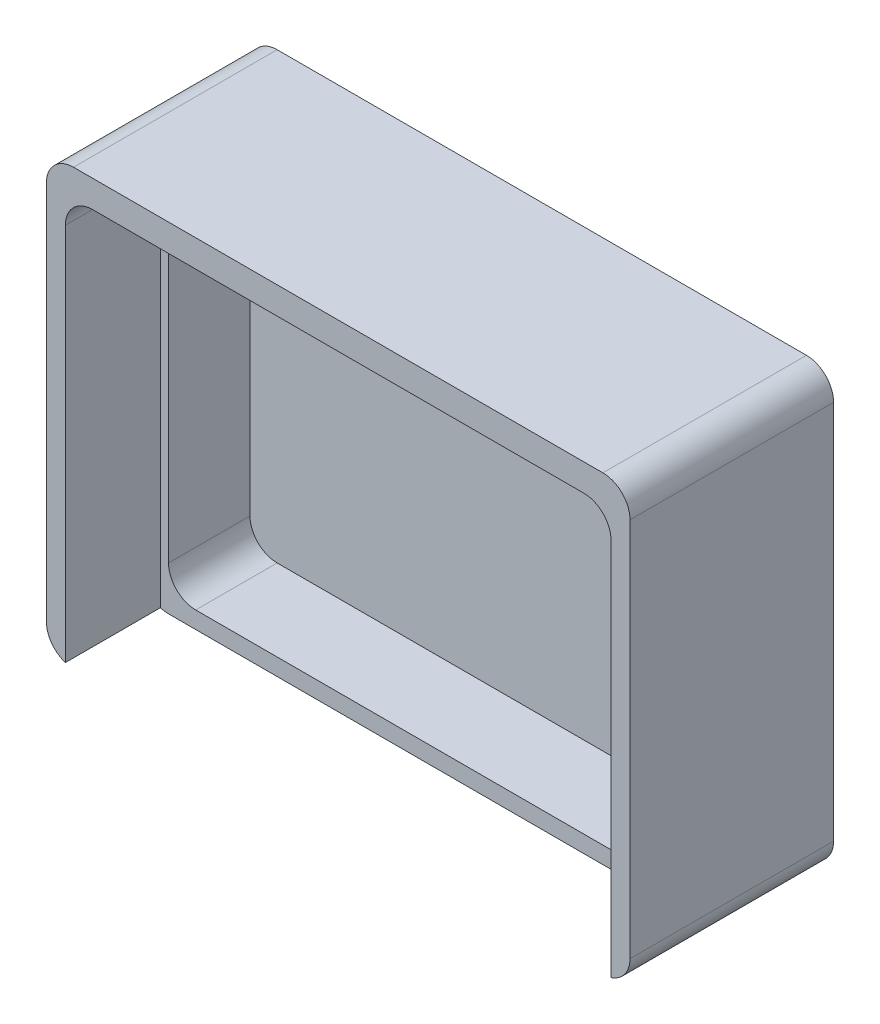
ISO-10303-21;
HEADER;
FILE_DESCRIPTION(('STEP AP214'),'2;1');
FILE_NAME('part.step','',(''),(''),'','','');
FILE_SCHEMA(('AUTOMOTIVE_DESIGN { 1 0 10303 214 1 1 1 1 }'));
ENDSEC;
DATA;
#1=APPLICATION_CONTEXT('core data for automotive mechanical design processes');
#2=APPLICATION_PROTOCOL_DEFINITION('international standard','automotive_design',2000,#1);
#3=PRODUCT_CONTEXT('',#1,'mechanical');
#4=PRODUCT('Part','Part','',(#3));
#5=PRODUCT_RELATED_PRODUCT_CATEGORY('part','',(#4));
#6=PRODUCT_DEFINITION_FORMATION('','',#4);
#7=PRODUCT_DEFINITION_CONTEXT('part definition',#1,'design');
#8=PRODUCT_DEFINITION('design','',#6,#7);
#9=PRODUCT_DEFINITION_SHAPE('','',#8);
#10=(LENGTH_UNIT() NAMED_UNIT(*) SI_UNIT(.MILLI.,.METRE.));
#11=(NAMED_UNIT(*) PLANE_ANGLE_UNIT() SI_UNIT($,.RADIAN.));
#12=(NAMED_UNIT(*) SI_UNIT($,.STERADIAN.) SOLID_ANGLE_UNIT());
#13=UNCERTAINTY_MEASURE_WITH_UNIT(LENGTH_MEASURE(1.E-05),#10,'distance_accuracy_value','');
#14=(GEOMETRIC_REPRESENTATION_CONTEXT(3) GLOBAL_UNCERTAINTY_ASSIGNED_CONTEXT((#13)) GLOBAL_UNIT_ASSIGNED_CONTEXT((#10,
#11,#12)) REPRESENTATION_CONTEXT('',''));
#15=CARTESIAN_POINT('',(0.,0.,0.));
#16=DIRECTION('',(0.,0.,1.));
#17=DIRECTION('',(1.,0.,0.));
#18=AXIS2_PLACEMENT_3D('',#15,#16,#17);
#19=CARTESIAN_POINT('',(21.5,15.125,15.));
#20=DIRECTION('',(-1.,0.,0.));
#21=DIRECTION('',(0.,-1.,0.));
#22=AXIS2_PLACEMENT_3D('',#19,#20,#21);
#23=PLANE('',#22);
#24=DIRECTION('',(0.,1.,0.));
#25=VECTOR('',#24,1.);
#26=CARTESIAN_POINT('',(21.5,15.125,15.));
#27=LINE('',#26,#25);
#28=CARTESIAN_POINT('',(21.5,-14.875,15.));
#29=VERTEX_POINT('',#28);
#30=CARTESIAN_POINT('',(21.5,13.125,15.));
#31=VERTEX_POINT('',#30);
#32=EDGE_CURVE('E244',#29,#31,#27,.T.);
#33=ORIENTED_EDGE('',*,*,#32,.F.);
#34=DIRECTION('',(0.,0.,-1.));
#35=VECTOR('',#34,1.);
#36=CARTESIAN_POINT('',(21.5,-14.875,15.));
#37=LINE('',#36,#35);
#38=CARTESIAN_POINT('',(21.5,-14.875,0.));
#39=VERTEX_POINT('',#38);
#40=EDGE_CURVE('E341',#29,#39,#37,.T.);
#41=ORIENTED_EDGE('',*,*,#40,.T.);
#42=DIRECTION('',(0.,1.,0.));
#43=VECTOR('',#42,1.);
#44=CARTESIAN_POINT('',(21.5,15.125,0.));
#45=LINE('',#44,#43);
#46=CARTESIAN_POINT('',(21.5,13.125,0.));
#47=VERTEX_POINT('',#46);
#48=EDGE_CURVE('E237',#39,#47,#45,.T.);
#49=ORIENTED_EDGE('',*,*,#48,.T.);
#50=DIRECTION('',(0.,0.,-1.));
#51=VECTOR('',#50,1.);
#52=CARTESIAN_POINT('',(21.5,13.125,15.));
#53=LINE('',#52,#51);
#54=EDGE_CURVE('E339',#47,#31,#53,.F.);
#55=ORIENTED_EDGE('',*,*,#54,.T.);
#56=EDGE_LOOP('',(#33,#41,#49,#55));
#57=FACE_BOUND('',#56,.T.);
#58=ADVANCED_FACE('F35',(#57),#23,.F.);
#59=CARTESIAN_POINT('',(21.5,15.125,15.));
#60=DIRECTION('',(0.,-1.,0.));
#61=DIRECTION('',(0.,0.,-1.));
#62=AXIS2_PLACEMENT_3D('',#59,#60,#61);
#63=PLANE('',#62);
#64=DIRECTION('',(-1.,0.,0.));
#65=VECTOR('',#64,1.);
#66=CARTESIAN_POINT('',(21.5,15.125,15.));
#67=LINE('',#66,#65);
#68=CARTESIAN_POINT('',(19.5,15.125,15.));
#69=VERTEX_POINT('',#68);
#70=CARTESIAN_POINT('',(-19.5,15.125,15.));
#71=VERTEX_POINT('',#70);
#72=EDGE_CURVE('E247',#69,#71,#67,.T.);
#73=ORIENTED_EDGE('',*,*,#72,.F.);
#74=DIRECTION('',(0.,0.,-1.));
#75=VECTOR('',#74,1.);
#76=CARTESIAN_POINT('',(19.5,15.125,15.));
#77=LINE('',#76,#75);
#78=CARTESIAN_POINT('',(19.5,15.125,0.));
#79=VERTEX_POINT('',#78);
#80=EDGE_CURVE('E11',#69,#79,#77,.T.);
#81=ORIENTED_EDGE('',*,*,#80,.T.);
#82=DIRECTION('',(-1.,0.,0.));
#83=VECTOR('',#82,1.);
#84=CARTESIAN_POINT('',(21.5,15.125,0.));
#85=LINE('',#84,#83);
#86=CARTESIAN_POINT('',(-19.5,15.125,0.));
#87=VERTEX_POINT('',#86);
#88=EDGE_CURVE('E256',#79,#87,#85,.T.);
#89=ORIENTED_EDGE('',*,*,#88,.T.);
#90=DIRECTION('',(0.,0.,-1.));
#91=VECTOR('',#90,1.);
#92=CARTESIAN_POINT('',(-19.5,15.125,15.));
#93=LINE('',#92,#91);
#94=EDGE_CURVE('E43',#87,#71,#93,.F.);
#95=ORIENTED_EDGE('',*,*,#94,.T.);
#96=EDGE_LOOP('',(#73,#81,#89,#95));
#97=FACE_BOUND('',#96,.T.);
#98=ADVANCED_FACE('F348',(#97),#63,.F.);
#99=CARTESIAN_POINT('',(-21.5,15.125,15.));
#100=DIRECTION('',(1.,0.,0.));
#101=DIRECTION('',(0.,1.,0.));
#102=AXIS2_PLACEMENT_3D('',#99,#100,#101);
#103=PLANE('',#102);
#104=DIRECTION('',(0.,-1.,0.));
#105=VECTOR('',#104,1.);
#106=CARTESIAN_POINT('',(-21.5,15.125,0.));
#107=LINE('',#106,#105);
#108=CARTESIAN_POINT('',(-21.5,13.125,0.));
#109=VERTEX_POINT('',#108);
#110=CARTESIAN_POINT('',(-21.5,-14.875,0.));
#111=VERTEX_POINT('',#110);
#112=EDGE_CURVE('E259',#109,#111,#107,.T.);
#113=ORIENTED_EDGE('',*,*,#112,.T.);
#114=DIRECTION('',(0.,0.,-1.));
#115=VECTOR('',#114,1.);
#116=CARTESIAN_POINT('',(-21.5,-14.875,15.));
#117=LINE('',#116,#115);
#118=CARTESIAN_POINT('',(-21.5,-14.875,15.));
#119=VERTEX_POINT('',#118);
#120=EDGE_CURVE('E325',#111,#119,#117,.F.);
#121=ORIENTED_EDGE('',*,*,#120,.T.);
#122=DIRECTION('',(0.,-1.,0.));
#123=VECTOR('',#122,1.);
#124=CARTESIAN_POINT('',(-21.5,15.125,15.));
#125=LINE('',#124,#123);
#126=CARTESIAN_POINT('',(-21.5,13.125,15.));
#127=VERTEX_POINT('',#126);
#128=EDGE_CURVE('E251',#127,#119,#125,.T.);
#129=ORIENTED_EDGE('',*,*,#128,.F.);
#130=DIRECTION('',(0.,0.,-1.));
#131=VECTOR('',#130,1.);
#132=CARTESIAN_POINT('',(-21.5,13.125,15.));
#133=LINE('',#132,#131);
#134=EDGE_CURVE('E322',#127,#109,#133,.T.);
#135=ORIENTED_EDGE('',*,*,#134,.T.);
#136=EDGE_LOOP('',(#113,#121,#129,#135));
#137=FACE_BOUND('',#136,.T.);
#138=ADVANCED_FACE('F360',(#137),#103,.F.);
#139=CARTESIAN_POINT('',(-21.5,-16.875,15.));
#140=DIRECTION('',(0.,1.,0.));
#141=DIRECTION('',(0.,0.,1.));
#142=AXIS2_PLACEMENT_3D('',#139,#140,#141);
#143=PLANE('',#142);
#144=DIRECTION('',(1.,0.,0.));
#145=VECTOR('',#144,1.);
#146=CARTESIAN_POINT('',(-20.1,-16.875,8.));
#147=LINE('',#146,#145);
#148=CARTESIAN_POINT('',(-19.5,-16.875,8.));
#149=VERTEX_POINT('',#148);
#150=CARTESIAN_POINT('',(19.5,-16.875,8.));
#151=VERTEX_POINT('',#150);
#152=EDGE_CURVE('E235',#149,#151,#147,.T.);
#153=ORIENTED_EDGE('',*,*,#152,.F.);
#154=DIRECTION('',(0.,0.,-1.));
#155=VECTOR('',#154,1.);
#156=CARTESIAN_POINT('',(-19.5,-16.875,15.));
#157=LINE('',#156,#155);
#158=CARTESIAN_POINT('',(-19.5,-16.875,0.));
#159=VERTEX_POINT('',#158);
#160=EDGE_CURVE('E311',#149,#159,#157,.T.);
#161=ORIENTED_EDGE('',*,*,#160,.T.);
#162=DIRECTION('',(1.,0.,0.));
#163=VECTOR('',#162,1.);
#164=CARTESIAN_POINT('',(-21.5,-16.875,0.));
#165=LINE('',#164,#163);
#166=CARTESIAN_POINT('',(19.5,-16.875,0.));
#167=VERTEX_POINT('',#166);
#168=EDGE_CURVE('E248',#159,#167,#165,.T.);
#169=ORIENTED_EDGE('',*,*,#168,.T.);
#170=DIRECTION('',(0.,0.,-1.));
#171=VECTOR('',#170,1.);
#172=CARTESIAN_POINT('',(19.5,-16.875,15.));
#173=LINE('',#172,#171);
#174=EDGE_CURVE('E309',#167,#151,#173,.F.);
#175=ORIENTED_EDGE('',*,*,#174,.T.);
#176=EDGE_LOOP('',(#153,#161,#169,#175));
#177=FACE_BOUND('',#176,.T.);
#178=ADVANCED_FACE('F372',(#177),#143,.F.);
#179=CARTESIAN_POINT('',(0.,0.,15.));
#180=DIRECTION('',(0.,0.,1.));
#181=DIRECTION('',(1.,0.,0.));
#182=AXIS2_PLACEMENT_3D('',#179,#180,#181);
#183=PLANE('',#182);
#184=ORIENTED_EDGE('',*,*,#128,.T.);
#185=CARTESIAN_POINT('',(-19.5,-14.875,15.));
#186=DIRECTION('',(0.,0.,1.));
#187=DIRECTION('',(1.,0.,0.));
#188=AXIS2_PLACEMENT_3D('',#185,#186,#187);
#189=CIRCLE('',#188,2.);
#190=CARTESIAN_POINT('',(-20.1,-16.7828784028339,15.));
#191=VERTEX_POINT('',#190);
#192=EDGE_CURVE('E333',#119,#191,#189,.T.);
#193=ORIENTED_EDGE('',*,*,#192,.T.);
#194=DIRECTION('',(0.,-1.,0.));
#195=VECTOR('',#194,1.);
#196=CARTESIAN_POINT('',(-20.1,13.125,15.));
#197=LINE('',#196,#195);
#198=CARTESIAN_POINT('',(-20.1,11.125,15.));
#199=VERTEX_POINT('',#198);
#200=EDGE_CURVE('E230',#199,#191,#197,.T.);
#201=ORIENTED_EDGE('',*,*,#200,.F.);
#202=CARTESIAN_POINT('',(-18.1,11.125,15.));
#203=DIRECTION('',(0.,0.,1.));
#204=DIRECTION('',(1.,0.,0.));
#205=AXIS2_PLACEMENT_3D('',#202,#203,#204);
#206=CIRCLE('',#205,2.);
#207=CARTESIAN_POINT('',(-18.1,13.125,15.));
#208=VERTEX_POINT('',#207);
#209=EDGE_CURVE('E307',#199,#208,#206,.F.);
#210=ORIENTED_EDGE('',*,*,#209,.T.);
#211=DIRECTION('',(-1.,0.,0.));
#212=VECTOR('',#211,1.);
#213=CARTESIAN_POINT('',(-20.1,13.125,15.));
#214=LINE('',#213,#212);
#215=CARTESIAN_POINT('',(18.1,13.125,15.));
#216=VERTEX_POINT('',#215);
#217=EDGE_CURVE('E240',#216,#208,#214,.T.);
#218=ORIENTED_EDGE('',*,*,#217,.F.);
#219=CARTESIAN_POINT('',(18.1,11.125,15.));
#220=DIRECTION('',(0.,0.,1.));
#221=DIRECTION('',(1.,0.,0.));
#222=AXIS2_PLACEMENT_3D('',#219,#220,#221);
#223=CIRCLE('',#222,2.);
#224=CARTESIAN_POINT('',(20.1,11.125,15.));
#225=VERTEX_POINT('',#224);
#226=EDGE_CURVE('E304',#216,#225,#223,.F.);
#227=ORIENTED_EDGE('',*,*,#226,.T.);
#228=DIRECTION('',(0.,1.,0.));
#229=VECTOR('',#228,1.);
#230=CARTESIAN_POINT('',(20.1,13.125,15.));
#231=LINE('',#230,#229);
#232=CARTESIAN_POINT('',(20.1,-16.7828784028339,15.));
#233=VERTEX_POINT('',#232);
#234=EDGE_CURVE('E238',#233,#225,#231,.T.);
#235=ORIENTED_EDGE('',*,*,#234,.F.);
#236=CARTESIAN_POINT('',(19.5,-14.875,15.));
#237=DIRECTION('',(0.,0.,1.));
#238=DIRECTION('',(1.,0.,0.));
#239=AXIS2_PLACEMENT_3D('',#236,#237,#238);
#240=CIRCLE('',#239,2.);
#241=EDGE_CURVE('E331',#233,#29,#240,.T.);
#242=ORIENTED_EDGE('',*,*,#241,.T.);
#243=ORIENTED_EDGE('',*,*,#32,.T.);
#244=CARTESIAN_POINT('',(19.5,13.125,15.));
#245=DIRECTION('',(0.,0.,1.));
#246=DIRECTION('',(1.,0.,0.));
#247=AXIS2_PLACEMENT_3D('',#244,#245,#246);
#248=CIRCLE('',#247,2.);
#249=EDGE_CURVE('E329',#31,#69,#248,.T.);
#250=ORIENTED_EDGE('',*,*,#249,.T.);
#251=ORIENTED_EDGE('',*,*,#72,.T.);
#252=CARTESIAN_POINT('',(-19.5,13.125,15.));
#253=DIRECTION('',(0.,0.,1.));
#254=DIRECTION('',(1.,0.,0.));
#255=AXIS2_PLACEMENT_3D('',#252,#253,#254);
#256=CIRCLE('',#255,2.);
#257=EDGE_CURVE('E327',#71,#127,#256,.T.);
#258=ORIENTED_EDGE('',*,*,#257,.T.);
#259=EDGE_LOOP('',(#184,#193,#201,#210,#218,#227,#235,#242,#243,#250,#251,#258));
#260=FACE_BOUND('',#259,.T.);
#261=ADVANCED_FACE('F354',(#260),#183,.T.);
#262=CARTESIAN_POINT('',(0.,0.,0.));
#263=DIRECTION('',(0.,0.,1.));
#264=DIRECTION('',(1.,0.,0.));
#265=AXIS2_PLACEMENT_3D('',#262,#263,#264);
#266=PLANE('',#265);
#267=ORIENTED_EDGE('',*,*,#168,.F.);
#268=CARTESIAN_POINT('',(-19.5,-14.875,0.));
#269=DIRECTION('',(0.,0.,1.));
#270=DIRECTION('',(1.,0.,0.));
#271=AXIS2_PLACEMENT_3D('',#268,#269,#270);
#272=CIRCLE('',#271,2.);
#273=EDGE_CURVE('E320',#159,#111,#272,.F.);
#274=ORIENTED_EDGE('',*,*,#273,.T.);
#275=ORIENTED_EDGE('',*,*,#112,.F.);
#276=CARTESIAN_POINT('',(-19.5,13.125,0.));
#277=DIRECTION('',(0.,0.,1.));
#278=DIRECTION('',(1.,0.,0.));
#279=AXIS2_PLACEMENT_3D('',#276,#277,#278);
#280=CIRCLE('',#279,2.);
#281=EDGE_CURVE('E314',#109,#87,#280,.F.);
#282=ORIENTED_EDGE('',*,*,#281,.T.);
#283=ORIENTED_EDGE('',*,*,#88,.F.);
#284=CARTESIAN_POINT('',(19.5,13.125,0.));
#285=DIRECTION('',(0.,0.,1.));
#286=DIRECTION('',(1.,0.,0.));
#287=AXIS2_PLACEMENT_3D('',#284,#285,#286);
#288=CIRCLE('',#287,2.);
#289=EDGE_CURVE('E316',#79,#47,#288,.F.);
#290=ORIENTED_EDGE('',*,*,#289,.T.);
#291=ORIENTED_EDGE('',*,*,#48,.F.);
#292=CARTESIAN_POINT('',(19.5,-14.875,0.));
#293=DIRECTION('',(0.,0.,1.));
#294=DIRECTION('',(1.,0.,0.));
#295=AXIS2_PLACEMENT_3D('',#292,#293,#294);
#296=CIRCLE('',#295,2.);
#297=EDGE_CURVE('E318',#39,#167,#296,.F.);
#298=ORIENTED_EDGE('',*,*,#297,.T.);
#299=EDGE_LOOP('',(#267,#274,#275,#282,#283,#290,#291,#298));
#300=FACE_BOUND('',#299,.T.);
#301=ADVANCED_FACE('F364',(#300),#266,.F.);
#302=CARTESIAN_POINT('',(20.1,13.125,8.));
#303=DIRECTION('',(1.,0.,0.));
#304=DIRECTION('',(0.,1.,0.));
#305=AXIS2_PLACEMENT_3D('',#302,#303,#304);
#306=PLANE('',#305);
#307=DIRECTION('',(0.,1.,0.));
#308=VECTOR('',#307,1.);
#309=CARTESIAN_POINT('',(20.1,13.125,8.));
#310=LINE('',#309,#308);
#311=CARTESIAN_POINT('',(20.1,-16.7828784028339,8.));
#312=VERTEX_POINT('',#311);
#313=CARTESIAN_POINT('',(20.1,11.125,8.));
#314=VERTEX_POINT('',#313);
#315=EDGE_CURVE('E227',#312,#314,#310,.T.);
#316=ORIENTED_EDGE('',*,*,#315,.F.);
#317=DIRECTION('',(0.,0.,-1.));
#318=VECTOR('',#317,1.);
#319=CARTESIAN_POINT('',(20.1,-16.7828784028339,8.));
#320=LINE('',#319,#318);
#321=EDGE_CURVE('E344',#312,#233,#320,.F.);
#322=ORIENTED_EDGE('',*,*,#321,.T.);
#323=ORIENTED_EDGE('',*,*,#234,.T.);
#324=DIRECTION('',(0.,0.,1.));
#325=VECTOR('',#324,1.);
#326=CARTESIAN_POINT('',(20.1,11.125,8.));
#327=LINE('',#326,#325);
#328=EDGE_CURVE('E291',#225,#314,#327,.F.);
#329=ORIENTED_EDGE('',*,*,#328,.T.);
#330=EDGE_LOOP('',(#316,#322,#323,#329));
#331=FACE_BOUND('',#330,.T.);
#332=ADVANCED_FACE('F381',(#331),#306,.F.);
#333=CARTESIAN_POINT('',(-20.1,13.125,8.));
#334=DIRECTION('',(-1.,0.,0.));
#335=DIRECTION('',(0.,-1.,0.));
#336=AXIS2_PLACEMENT_3D('',#333,#334,#335);
#337=PLANE('',#336);
#338=ORIENTED_EDGE('',*,*,#200,.T.);
#339=DIRECTION('',(0.,0.,-1.));
#340=VECTOR('',#339,1.);
#341=CARTESIAN_POINT('',(-20.1,-16.7828784028339,15.));
#342=LINE('',#341,#340);
#343=CARTESIAN_POINT('',(-20.1,-16.7828784028339,8.));
#344=VERTEX_POINT('',#343);
#345=EDGE_CURVE('E58',#191,#344,#342,.T.);
#346=ORIENTED_EDGE('',*,*,#345,.T.);
#347=DIRECTION('',(0.,-1.,0.));
#348=VECTOR('',#347,1.);
#349=CARTESIAN_POINT('',(-20.1,13.125,8.));
#350=LINE('',#349,#348);
#351=CARTESIAN_POINT('',(-20.1,11.125,8.));
#352=VERTEX_POINT('',#351);
#353=EDGE_CURVE('E233',#352,#344,#350,.T.);
#354=ORIENTED_EDGE('',*,*,#353,.F.);
#355=DIRECTION('',(0.,0.,1.));
#356=VECTOR('',#355,1.);
#357=CARTESIAN_POINT('',(-20.1,11.125,15.));
#358=LINE('',#357,#356);
#359=EDGE_CURVE('E198',#352,#199,#358,.T.);
#360=ORIENTED_EDGE('',*,*,#359,.T.);
#361=EDGE_LOOP('',(#338,#346,#354,#360));
#362=FACE_BOUND('',#361,.T.);
#363=ADVANCED_FACE('F397',(#362),#337,.F.);
#364=CARTESIAN_POINT('',(-20.1,13.125,8.));
#365=DIRECTION('',(0.,1.,0.));
#366=DIRECTION('',(0.,0.,1.));
#367=AXIS2_PLACEMENT_3D('',#364,#365,#366);
#368=PLANE('',#367);
#369=DIRECTION('',(-1.,0.,0.));
#370=VECTOR('',#369,1.);
#371=CARTESIAN_POINT('',(-20.1,13.125,8.));
#372=LINE('',#371,#370);
#373=CARTESIAN_POINT('',(18.1,13.125,8.));
#374=VERTEX_POINT('',#373);
#375=CARTESIAN_POINT('',(-18.1,13.125,8.));
#376=VERTEX_POINT('',#375);
#377=EDGE_CURVE('E229',#374,#376,#372,.T.);
#378=ORIENTED_EDGE('',*,*,#377,.F.);
#379=DIRECTION('',(0.,0.,1.));
#380=VECTOR('',#379,1.);
#381=CARTESIAN_POINT('',(18.1,13.125,15.));
#382=LINE('',#381,#380);
#383=EDGE_CURVE('E288',#374,#216,#382,.T.);
#384=ORIENTED_EDGE('',*,*,#383,.T.);
#385=ORIENTED_EDGE('',*,*,#217,.T.);
#386=DIRECTION('',(0.,0.,1.));
#387=VECTOR('',#386,1.);
#388=CARTESIAN_POINT('',(-18.1,13.125,8.));
#389=LINE('',#388,#387);
#390=EDGE_CURVE('E286',#208,#376,#389,.F.);
#391=ORIENTED_EDGE('',*,*,#390,.T.);
#392=EDGE_LOOP('',(#378,#384,#385,#391));
#393=FACE_BOUND('',#392,.T.);
#394=ADVANCED_FACE('F392',(#393),#368,.F.);
#395=CARTESIAN_POINT('',(0.,0.,8.));
#396=DIRECTION('',(0.,0.,1.));
#397=DIRECTION('',(1.,0.,0.));
#398=AXIS2_PLACEMENT_3D('',#395,#396,#397);
#399=PLANE('',#398);
#400=DIRECTION('',(0.,1.,0.));
#401=VECTOR('',#400,1.);
#402=CARTESIAN_POINT('',(19.5,12.375,8.));
#403=LINE('',#402,#401);
#404=CARTESIAN_POINT('',(19.5,-13.625,8.));
#405=VERTEX_POINT('',#404);
#406=CARTESIAN_POINT('',(19.5,10.375,8.));
#407=VERTEX_POINT('',#406);
#408=EDGE_CURVE('E204',#405,#407,#403,.T.);
#409=ORIENTED_EDGE('',*,*,#408,.F.);
#410=CARTESIAN_POINT('',(17.5,-13.625,8.));
#411=DIRECTION('',(0.,0.,1.));
#412=DIRECTION('',(1.,0.,0.));
#413=AXIS2_PLACEMENT_3D('',#410,#411,#412);
#414=CIRCLE('',#413,2.);
#415=CARTESIAN_POINT('',(17.5,-15.625,8.));
#416=VERTEX_POINT('',#415);
#417=EDGE_CURVE('E187',#405,#416,#414,.F.);
#418=ORIENTED_EDGE('',*,*,#417,.T.);
#419=DIRECTION('',(1.,0.,0.));
#420=VECTOR('',#419,1.);
#421=CARTESIAN_POINT('',(-19.5,-15.625,8.));
#422=LINE('',#421,#420);
#423=CARTESIAN_POINT('',(-17.5,-15.625,8.));
#424=VERTEX_POINT('',#423);
#425=EDGE_CURVE('E225',#424,#416,#422,.T.);
#426=ORIENTED_EDGE('',*,*,#425,.F.);
#427=CARTESIAN_POINT('',(-17.5,-13.625,8.));
#428=DIRECTION('',(0.,0.,1.));
#429=DIRECTION('',(1.,0.,0.));
#430=AXIS2_PLACEMENT_3D('',#427,#428,#429);
#431=CIRCLE('',#430,2.);
#432=CARTESIAN_POINT('',(-19.5,-13.625,8.));
#433=VERTEX_POINT('',#432);
#434=EDGE_CURVE('E197',#424,#433,#431,.F.);
#435=ORIENTED_EDGE('',*,*,#434,.T.);
#436=DIRECTION('',(0.,-1.,0.));
#437=VECTOR('',#436,1.);
#438=CARTESIAN_POINT('',(-19.5,12.375,8.));
#439=LINE('',#438,#437);
#440=CARTESIAN_POINT('',(-19.5,10.375,8.));
#441=VERTEX_POINT('',#440);
#442=EDGE_CURVE('E217',#441,#433,#439,.T.);
#443=ORIENTED_EDGE('',*,*,#442,.F.);
#444=CARTESIAN_POINT('',(-17.5,10.375,8.));
#445=DIRECTION('',(0.,0.,1.));
#446=DIRECTION('',(1.,0.,0.));
#447=AXIS2_PLACEMENT_3D('',#444,#445,#446);
#448=CIRCLE('',#447,2.);
#449=CARTESIAN_POINT('',(-17.5,12.375,8.));
#450=VERTEX_POINT('',#449);
#451=EDGE_CURVE('E302',#441,#450,#448,.F.);
#452=ORIENTED_EDGE('',*,*,#451,.T.);
#453=DIRECTION('',(-1.,0.,0.));
#454=VECTOR('',#453,1.);
#455=CARTESIAN_POINT('',(-19.5,12.375,8.));
#456=LINE('',#455,#454);
#457=CARTESIAN_POINT('',(17.5,12.375,8.));
#458=VERTEX_POINT('',#457);
#459=EDGE_CURVE('E214',#458,#450,#456,.T.);
#460=ORIENTED_EDGE('',*,*,#459,.F.);
#461=CARTESIAN_POINT('',(17.5,10.375,8.));
#462=DIRECTION('',(0.,0.,1.));
#463=DIRECTION('',(1.,0.,0.));
#464=AXIS2_PLACEMENT_3D('',#461,#462,#463);
#465=CIRCLE('',#464,2.);
#466=EDGE_CURVE('E213',#458,#407,#465,.F.);
#467=ORIENTED_EDGE('',*,*,#466,.T.);
#468=EDGE_LOOP('',(#409,#418,#426,#435,#443,#452,#460,#467));
#469=FACE_BOUND('',#468,.T.);
#470=ORIENTED_EDGE('',*,*,#353,.T.);
#471=CARTESIAN_POINT('',(-19.5,-14.875,8.));
#472=DIRECTION('',(0.,0.,1.));
#473=DIRECTION('',(1.,0.,0.));
#474=AXIS2_PLACEMENT_3D('',#471,#472,#473);
#475=CIRCLE('',#474,2.);
#476=EDGE_CURVE('E337',#344,#149,#475,.T.);
#477=ORIENTED_EDGE('',*,*,#476,.T.);
#478=ORIENTED_EDGE('',*,*,#152,.T.);
#479=CARTESIAN_POINT('',(19.5,-14.875,8.));
#480=DIRECTION('',(0.,0.,1.));
#481=DIRECTION('',(1.,0.,0.));
#482=AXIS2_PLACEMENT_3D('',#479,#480,#481);
#483=CIRCLE('',#482,2.);
#484=EDGE_CURVE('E50',#151,#312,#483,.T.);
#485=ORIENTED_EDGE('',*,*,#484,.T.);
#486=ORIENTED_EDGE('',*,*,#315,.T.);
#487=CARTESIAN_POINT('',(18.1,11.125,8.));
#488=DIRECTION('',(0.,0.,1.));
#489=DIRECTION('',(1.,0.,0.));
#490=AXIS2_PLACEMENT_3D('',#487,#488,#489);
#491=CIRCLE('',#490,2.);
#492=EDGE_CURVE('E296',#314,#374,#491,.T.);
#493=ORIENTED_EDGE('',*,*,#492,.T.);
#494=ORIENTED_EDGE('',*,*,#377,.T.);
#495=CARTESIAN_POINT('',(-18.1,11.125,8.));
#496=DIRECTION('',(0.,0.,1.));
#497=DIRECTION('',(1.,0.,0.));
#498=AXIS2_PLACEMENT_3D('',#495,#496,#497);
#499=CIRCLE('',#498,2.);
#500=EDGE_CURVE('E294',#376,#352,#499,.T.);
#501=ORIENTED_EDGE('',*,*,#500,.T.);
#502=EDGE_LOOP('',(#470,#477,#478,#485,#486,#493,#494,#501));
#503=FACE_BOUND('',#502,.T.);
#504=ADVANCED_FACE('F211',(#469,#503),#399,.T.);
#505=CARTESIAN_POINT('',(19.5,12.375,2.));
#506=DIRECTION('',(1.,0.,0.));
#507=DIRECTION('',(0.,1.,0.));
#508=AXIS2_PLACEMENT_3D('',#505,#506,#507);
#509=PLANE('',#508);
#510=DIRECTION('',(0.,1.,0.));
#511=VECTOR('',#510,1.);
#512=CARTESIAN_POINT('',(19.5,12.375,2.));
#513=LINE('',#512,#511);
#514=CARTESIAN_POINT('',(19.5,-13.625,2.));
#515=VERTEX_POINT('',#514);
#516=CARTESIAN_POINT('',(19.5,10.375,2.));
#517=VERTEX_POINT('',#516);
#518=EDGE_CURVE('E207',#515,#517,#513,.T.);
#519=ORIENTED_EDGE('',*,*,#518,.F.);
#520=DIRECTION('',(0.,0.,1.));
#521=VECTOR('',#520,1.);
#522=CARTESIAN_POINT('',(19.5,-13.625,8.));
#523=LINE('',#522,#521);
#524=EDGE_CURVE('E191',#515,#405,#523,.T.);
#525=ORIENTED_EDGE('',*,*,#524,.T.);
#526=ORIENTED_EDGE('',*,*,#408,.T.);
#527=DIRECTION('',(0.,0.,1.));
#528=VECTOR('',#527,1.);
#529=CARTESIAN_POINT('',(19.5,10.375,2.));
#530=LINE('',#529,#528);
#531=EDGE_CURVE('E209',#407,#517,#530,.F.);
#532=ORIENTED_EDGE('',*,*,#531,.T.);
#533=EDGE_LOOP('',(#519,#525,#526,#532));
#534=FACE_BOUND('',#533,.T.);
#535=ADVANCED_FACE('F203',(#534),#509,.F.);
#536=CARTESIAN_POINT('',(-19.5,-15.625,2.));
#537=DIRECTION('',(0.,-1.,0.));
#538=DIRECTION('',(0.,0.,-1.));
#539=AXIS2_PLACEMENT_3D('',#536,#537,#538);
#540=PLANE('',#539);
#541=ORIENTED_EDGE('',*,*,#425,.T.);
#542=DIRECTION('',(0.,0.,1.));
#543=VECTOR('',#542,1.);
#544=CARTESIAN_POINT('',(17.5,-15.625,2.));
#545=LINE('',#544,#543);
#546=CARTESIAN_POINT('',(17.5,-15.625,2.));
#547=VERTEX_POINT('',#546);
#548=EDGE_CURVE('E192',#416,#547,#545,.F.);
#549=ORIENTED_EDGE('',*,*,#548,.T.);
#550=DIRECTION('',(1.,0.,0.));
#551=VECTOR('',#550,1.);
#552=CARTESIAN_POINT('',(-19.5,-15.625,2.));
#553=LINE('',#552,#551);
#554=CARTESIAN_POINT('',(-17.5,-15.625,2.));
#555=VERTEX_POINT('',#554);
#556=EDGE_CURVE('E220',#555,#547,#553,.T.);
#557=ORIENTED_EDGE('',*,*,#556,.F.);
#558=DIRECTION('',(0.,0.,1.));
#559=VECTOR('',#558,1.);
#560=CARTESIAN_POINT('',(-17.5,-15.625,8.));
#561=LINE('',#560,#559);
#562=EDGE_CURVE('E208',#555,#424,#561,.T.);
#563=ORIENTED_EDGE('',*,*,#562,.T.);
#564=EDGE_LOOP('',(#541,#549,#557,#563));
#565=FACE_BOUND('',#564,.T.);
#566=ADVANCED_FACE('F591',(#565),#540,.F.);
#567=CARTESIAN_POINT('',(-19.5,12.375,2.));
#568=DIRECTION('',(-1.,0.,0.));
#569=DIRECTION('',(0.,0.,1.));
#570=AXIS2_PLACEMENT_3D('',#567,#568,#569);
#571=PLANE('',#570);
#572=ORIENTED_EDGE('',*,*,#442,.T.);
#573=DIRECTION('',(0.,0.,1.));
#574=VECTOR('',#573,1.);
#575=CARTESIAN_POINT('',(-19.5,-13.625,2.));
#576=LINE('',#575,#574);
#577=CARTESIAN_POINT('',(-19.5,-13.625,2.));
#578=VERTEX_POINT('',#577);
#579=EDGE_CURVE('E279',#433,#578,#576,.F.);
#580=ORIENTED_EDGE('',*,*,#579,.T.);
#581=DIRECTION('',(0.,-1.,0.));
#582=VECTOR('',#581,1.);
#583=CARTESIAN_POINT('',(-19.5,12.375,2.));
#584=LINE('',#583,#582);
#585=CARTESIAN_POINT('',(-19.5,10.375,2.));
#586=VERTEX_POINT('',#585);
#587=EDGE_CURVE('E625',#586,#578,#584,.T.);
#588=ORIENTED_EDGE('',*,*,#587,.F.);
#589=DIRECTION('',(0.,0.,1.));
#590=VECTOR('',#589,1.);
#591=CARTESIAN_POINT('',(-19.5,10.375,8.));
#592=LINE('',#591,#590);
#593=EDGE_CURVE('E276',#586,#441,#592,.T.);
#594=ORIENTED_EDGE('',*,*,#593,.T.);
#595=EDGE_LOOP('',(#572,#580,#588,#594));
#596=FACE_BOUND('',#595,.T.);
#597=ADVANCED_FACE('F581',(#596),#571,.F.);
#598=CARTESIAN_POINT('',(-19.5,12.375,2.));
#599=DIRECTION('',(0.,1.,0.));
#600=DIRECTION('',(0.,0.,1.));
#601=AXIS2_PLACEMENT_3D('',#598,#599,#600);
#602=PLANE('',#601);
#603=DIRECTION('',(-1.,0.,0.));
#604=VECTOR('',#603,1.);
#605=CARTESIAN_POINT('',(-19.5,12.375,2.));
#606=LINE('',#605,#604);
#607=CARTESIAN_POINT('',(17.5,12.375,2.));
#608=VERTEX_POINT('',#607);
#609=CARTESIAN_POINT('',(-17.5,12.375,2.));
#610=VERTEX_POINT('',#609);
#611=EDGE_CURVE('E626',#608,#610,#606,.T.);
#612=ORIENTED_EDGE('',*,*,#611,.F.);
#613=DIRECTION('',(0.,0.,1.));
#614=VECTOR('',#613,1.);
#615=CARTESIAN_POINT('',(17.5,12.375,8.));
#616=LINE('',#615,#614);
#617=EDGE_CURVE('E283',#608,#458,#616,.T.);
#618=ORIENTED_EDGE('',*,*,#617,.T.);
#619=ORIENTED_EDGE('',*,*,#459,.T.);
#620=DIRECTION('',(0.,0.,1.));
#621=VECTOR('',#620,1.);
#622=CARTESIAN_POINT('',(-17.5,12.375,2.));
#623=LINE('',#622,#621);
#624=EDGE_CURVE('E281',#450,#610,#623,.F.);
#625=ORIENTED_EDGE('',*,*,#624,.T.);
#626=EDGE_LOOP('',(#612,#618,#619,#625));
#627=FACE_BOUND('',#626,.T.);
#628=ADVANCED_FACE('F571',(#627),#602,.F.);
#629=CARTESIAN_POINT('',(0.,0.,2.));
#630=DIRECTION('',(0.,0.,1.));
#631=DIRECTION('',(1.,0.,0.));
#632=AXIS2_PLACEMENT_3D('',#629,#630,#631);
#633=PLANE('',#632);
#634=ORIENTED_EDGE('',*,*,#556,.T.);
#635=CARTESIAN_POINT('',(17.5,-13.625,2.));
#636=DIRECTION('',(0.,0.,1.));
#637=DIRECTION('',(1.,0.,0.));
#638=AXIS2_PLACEMENT_3D('',#635,#636,#637);
#639=CIRCLE('',#638,2.);
#640=EDGE_CURVE('E274',#547,#515,#639,.T.);
#641=ORIENTED_EDGE('',*,*,#640,.T.);
#642=ORIENTED_EDGE('',*,*,#518,.T.);
#643=CARTESIAN_POINT('',(17.5,10.375,2.));
#644=DIRECTION('',(0.,0.,1.));
#645=DIRECTION('',(1.,0.,0.));
#646=AXIS2_PLACEMENT_3D('',#643,#644,#645);
#647=CIRCLE('',#646,2.);
#648=EDGE_CURVE('E270',#517,#608,#647,.T.);
#649=ORIENTED_EDGE('',*,*,#648,.T.);
#650=ORIENTED_EDGE('',*,*,#611,.T.);
#651=CARTESIAN_POINT('',(-17.5,10.375,2.));
#652=DIRECTION('',(0.,0.,1.));
#653=DIRECTION('',(1.,0.,0.));
#654=AXIS2_PLACEMENT_3D('',#651,#652,#653);
#655=CIRCLE('',#654,2.);
#656=EDGE_CURVE('E268',#610,#586,#655,.T.);
#657=ORIENTED_EDGE('',*,*,#656,.T.);
#658=ORIENTED_EDGE('',*,*,#587,.T.);
#659=CARTESIAN_POINT('',(-17.5,-13.625,2.));
#660=DIRECTION('',(0.,0.,1.));
#661=DIRECTION('',(1.,0.,0.));
#662=AXIS2_PLACEMENT_3D('',#659,#660,#661);
#663=CIRCLE('',#662,2.);
#664=EDGE_CURVE('E272',#578,#555,#663,.T.);
#665=ORIENTED_EDGE('',*,*,#664,.T.);
#666=EDGE_LOOP('',(#634,#641,#642,#649,#650,#657,#658,#665));
#667=FACE_BOUND('',#666,.T.);
#668=ADVANCED_FACE('F420',(#667),#633,.T.);
#669=CARTESIAN_POINT('',(17.5,-13.625,2.));
#670=DIRECTION('',(0.,0.,-1.));
#671=DIRECTION('',(-1.,0.,0.));
#672=AXIS2_PLACEMENT_3D('',#669,#670,#671);
#673=CYLINDRICAL_SURFACE('',#672,2.);
#674=ORIENTED_EDGE('',*,*,#640,.F.);
#675=ORIENTED_EDGE('',*,*,#548,.F.);
#676=ORIENTED_EDGE('',*,*,#417,.F.);
#677=ORIENTED_EDGE('',*,*,#524,.F.);
#678=EDGE_LOOP('',(#674,#675,#676,#677));
#679=FACE_BOUND('',#678,.T.);
#680=ADVANCED_FACE('F190',(#679),#673,.F.);
#681=CARTESIAN_POINT('',(-17.5,-13.625,2.));
#682=DIRECTION('',(0.,0.,-1.));
#683=DIRECTION('',(-1.,0.,0.));
#684=AXIS2_PLACEMENT_3D('',#681,#682,#683);
#685=CYLINDRICAL_SURFACE('',#684,2.);
#686=ORIENTED_EDGE('',*,*,#664,.F.);
#687=ORIENTED_EDGE('',*,*,#579,.F.);
#688=ORIENTED_EDGE('',*,*,#434,.F.);
#689=ORIENTED_EDGE('',*,*,#562,.F.);
#690=EDGE_LOOP('',(#686,#687,#688,#689));
#691=FACE_BOUND('',#690,.T.);
#692=ADVANCED_FACE('F419',(#691),#685,.F.);
#693=CARTESIAN_POINT('',(17.5,10.375,2.));
#694=DIRECTION('',(0.,0.,-1.));
#695=DIRECTION('',(-1.,0.,0.));
#696=AXIS2_PLACEMENT_3D('',#693,#694,#695);
#697=CYLINDRICAL_SURFACE('',#696,2.);
#698=ORIENTED_EDGE('',*,*,#648,.F.);
#699=ORIENTED_EDGE('',*,*,#531,.F.);
#700=ORIENTED_EDGE('',*,*,#466,.F.);
#701=ORIENTED_EDGE('',*,*,#617,.F.);
#702=EDGE_LOOP('',(#698,#699,#700,#701));
#703=FACE_BOUND('',#702,.T.);
#704=ADVANCED_FACE('F423',(#703),#697,.F.);
#705=CARTESIAN_POINT('',(-17.5,10.375,2.));
#706=DIRECTION('',(0.,0.,-1.));
#707=DIRECTION('',(-1.,0.,0.));
#708=AXIS2_PLACEMENT_3D('',#705,#706,#707);
#709=CYLINDRICAL_SURFACE('',#708,2.);
#710=ORIENTED_EDGE('',*,*,#656,.F.);
#711=ORIENTED_EDGE('',*,*,#624,.F.);
#712=ORIENTED_EDGE('',*,*,#451,.F.);
#713=ORIENTED_EDGE('',*,*,#593,.F.);
#714=EDGE_LOOP('',(#710,#711,#712,#713));
#715=FACE_BOUND('',#714,.T.);
#716=ADVANCED_FACE('F427',(#715),#709,.F.);
#717=CARTESIAN_POINT('',(18.1,11.125,8.));
#718=DIRECTION('',(0.,0.,-1.));
#719=DIRECTION('',(-1.,0.,0.));
#720=AXIS2_PLACEMENT_3D('',#717,#718,#719);
#721=CYLINDRICAL_SURFACE('',#720,2.);
#722=ORIENTED_EDGE('',*,*,#492,.F.);
#723=ORIENTED_EDGE('',*,*,#328,.F.);
#724=ORIENTED_EDGE('',*,*,#226,.F.);
#725=ORIENTED_EDGE('',*,*,#383,.F.);
#726=EDGE_LOOP('',(#722,#723,#724,#725));
#727=FACE_BOUND('',#726,.T.);
#728=ADVANCED_FACE('F388',(#727),#721,.F.);
#729=CARTESIAN_POINT('',(-18.1,11.125,8.));
#730=DIRECTION('',(0.,0.,-1.));
#731=DIRECTION('',(-1.,0.,0.));
#732=AXIS2_PLACEMENT_3D('',#729,#730,#731);
#733=CYLINDRICAL_SURFACE('',#732,2.);
#734=ORIENTED_EDGE('',*,*,#500,.F.);
#735=ORIENTED_EDGE('',*,*,#390,.F.);
#736=ORIENTED_EDGE('',*,*,#209,.F.);
#737=ORIENTED_EDGE('',*,*,#359,.F.);
#738=EDGE_LOOP('',(#734,#735,#736,#737));
#739=FACE_BOUND('',#738,.T.);
#740=ADVANCED_FACE('F395',(#739),#733,.F.);
#741=CARTESIAN_POINT('',(-19.5,-14.875,15.));
#742=DIRECTION('',(0.,0.,-1.));
#743=DIRECTION('',(-1.,0.,0.));
#744=AXIS2_PLACEMENT_3D('',#741,#742,#743);
#745=CYLINDRICAL_SURFACE('',#744,2.);
#746=ORIENTED_EDGE('',*,*,#192,.F.);
#747=ORIENTED_EDGE('',*,*,#120,.F.);
#748=ORIENTED_EDGE('',*,*,#273,.F.);
#749=ORIENTED_EDGE('',*,*,#160,.F.);
#750=ORIENTED_EDGE('',*,*,#476,.F.);
#751=ORIENTED_EDGE('',*,*,#345,.F.);
#752=EDGE_LOOP('',(#746,#747,#748,#749,#750,#751));
#753=FACE_BOUND('',#752,.T.);
#754=ADVANCED_FACE('F368',(#753),#745,.T.);
#755=CARTESIAN_POINT('',(19.5,-14.875,15.));
#756=DIRECTION('',(0.,0.,-1.));
#757=DIRECTION('',(-1.,0.,0.));
#758=AXIS2_PLACEMENT_3D('',#755,#756,#757);
#759=CYLINDRICAL_SURFACE('',#758,2.);
#760=ORIENTED_EDGE('',*,*,#484,.F.);
#761=ORIENTED_EDGE('',*,*,#174,.F.);
#762=ORIENTED_EDGE('',*,*,#297,.F.);
#763=ORIENTED_EDGE('',*,*,#40,.F.);
#764=ORIENTED_EDGE('',*,*,#241,.F.);
#765=ORIENTED_EDGE('',*,*,#321,.F.);
#766=EDGE_LOOP('',(#760,#761,#762,#763,#764,#765));
#767=FACE_BOUND('',#766,.T.);
#768=ADVANCED_FACE('F376',(#767),#759,.T.);
#769=CARTESIAN_POINT('',(19.5,13.125,15.));
#770=DIRECTION('',(0.,0.,-1.));
#771=DIRECTION('',(-1.,0.,0.));
#772=AXIS2_PLACEMENT_3D('',#769,#770,#771);
#773=CYLINDRICAL_SURFACE('',#772,2.);
#774=ORIENTED_EDGE('',*,*,#249,.F.);
#775=ORIENTED_EDGE('',*,*,#54,.F.);
#776=ORIENTED_EDGE('',*,*,#289,.F.);
#777=ORIENTED_EDGE('',*,*,#80,.F.);
#778=EDGE_LOOP('',(#774,#775,#776,#777));
#779=FACE_BOUND('',#778,.T.);
#780=ADVANCED_FACE('F439',(#779),#773,.T.);
#781=CARTESIAN_POINT('',(-19.5,13.125,15.));
#782=DIRECTION('',(0.,0.,-1.));
#783=DIRECTION('',(-1.,0.,0.));
#784=AXIS2_PLACEMENT_3D('',#781,#782,#783);
#785=CYLINDRICAL_SURFACE('',#784,2.);
#786=ORIENTED_EDGE('',*,*,#257,.F.);
#787=ORIENTED_EDGE('',*,*,#94,.F.);
#788=ORIENTED_EDGE('',*,*,#281,.F.);
#789=ORIENTED_EDGE('',*,*,#134,.F.);
#790=EDGE_LOOP('',(#786,#787,#788,#789));
#791=FACE_BOUND('',#790,.T.);
#792=ADVANCED_FACE('F37',(#791),#785,.T.);
#793=CLOSED_SHELL('',(#58,#98,#138,#178,#261,#301,#332,#363,#394,#504,#535,#566,#597,#628,#668,
#680,#692,#704,#716,#728,#740,#754,#768,#780,#792));
#794=MANIFOLD_SOLID_BREP('B2',#793);
#795=ADVANCED_BREP_SHAPE_REPRESENTATION('',(#18,#794),#14);
#796=SHAPE_DEFINITION_REPRESENTATION(#9,#795);
ENDSEC;
END-ISO-10303-21;
